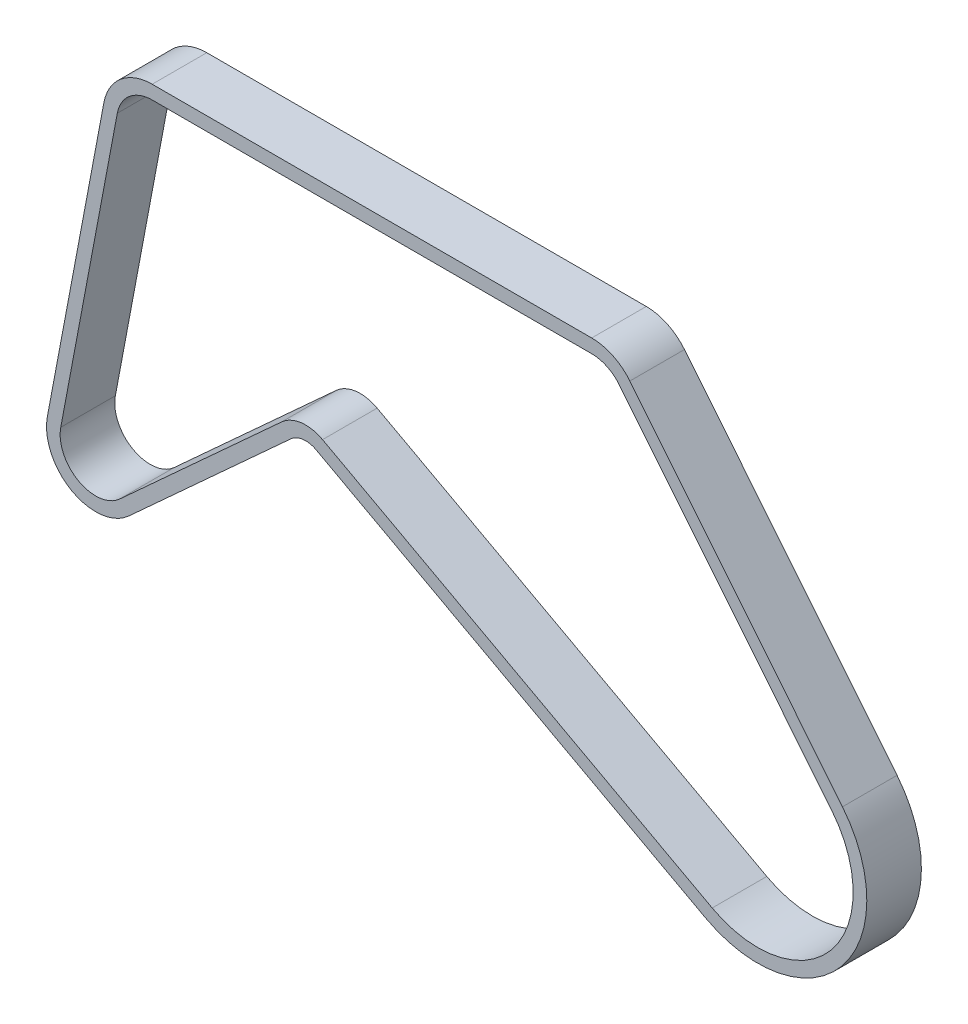
ISO-10303-21;
HEADER;
FILE_DESCRIPTION(('STEP AP214'),'2;1');
FILE_NAME('part.step','',(''),(''),'','','');
FILE_SCHEMA(('AUTOMOTIVE_DESIGN { 1 0 10303 214 1 1 1 1 }'));
ENDSEC;
DATA;
#1=APPLICATION_CONTEXT('core data for automotive mechanical design processes');
#2=APPLICATION_PROTOCOL_DEFINITION('international standard','automotive_design',2000,#1);
#3=PRODUCT_CONTEXT('',#1,'mechanical');
#4=PRODUCT('Part','Part','',(#3));
#5=PRODUCT_RELATED_PRODUCT_CATEGORY('part','',(#4));
#6=PRODUCT_DEFINITION_FORMATION('','',#4);
#7=PRODUCT_DEFINITION_CONTEXT('part definition',#1,'design');
#8=PRODUCT_DEFINITION('design','',#6,#7);
#9=PRODUCT_DEFINITION_SHAPE('','',#8);
#10=(LENGTH_UNIT() NAMED_UNIT(*) SI_UNIT(.MILLI.,.METRE.));
#11=(NAMED_UNIT(*) PLANE_ANGLE_UNIT() SI_UNIT($,.RADIAN.));
#12=(NAMED_UNIT(*) SI_UNIT($,.STERADIAN.) SOLID_ANGLE_UNIT());
#13=UNCERTAINTY_MEASURE_WITH_UNIT(LENGTH_MEASURE(1.E-05),#10,'distance_accuracy_value','');
#14=(GEOMETRIC_REPRESENTATION_CONTEXT(3) GLOBAL_UNCERTAINTY_ASSIGNED_CONTEXT((#13)) GLOBAL_UNIT_ASSIGNED_CONTEXT((#10,
#11,#12)) REPRESENTATION_CONTEXT('',''));
#15=CARTESIAN_POINT('',(0.,0.,0.));
#16=DIRECTION('',(0.,0.,1.));
#17=DIRECTION('',(1.,0.,0.));
#18=AXIS2_PLACEMENT_3D('',#15,#16,#17);
#19=CARTESIAN_POINT('',(-165.587686167173,35.,10.));
#20=DIRECTION('',(0.,0.,-1.));
#21=DIRECTION('',(-1.,0.,0.));
#22=AXIS2_PLACEMENT_3D('',#19,#20,#21);
#23=PLANE('',#22);
#24=CARTESIAN_POINT('',(-165.587686167173,35.,10.));
#25=DIRECTION('',(0.,0.,-1.));
#26=DIRECTION('',(-1.,0.,0.));
#27=AXIS2_PLACEMENT_3D('',#24,#25,#26);
#28=CIRCLE('',#27,8.);
#29=CARTESIAN_POINT('',(-170.979219547743,40.9102764576799,10.));
#30=VERTEX_POINT('',#29);
#31=CARTESIAN_POINT('',(-161.781383654942,42.0364807386491,10.));
#32=VERTEX_POINT('',#31);
#33=EDGE_CURVE('E311',#30,#32,#28,.T.);
#34=ORIENTED_EDGE('',*,*,#33,.T.);
#35=DIRECTION('',(0.879560092331139,-0.475787814028941,0.));
#36=VECTOR('',#35,1.);
#37=CARTESIAN_POINT('',(-161.781383654942,42.0364807386491,10.));
#38=LINE('',#37,#36);
#39=CARTESIAN_POINT('',(-19.0315125611577,-35.1824036932456,10.));
#40=VERTEX_POINT('',#39);
#41=EDGE_CURVE('E314',#32,#40,#38,.T.);
#42=ORIENTED_EDGE('',*,*,#41,.T.);
#43=CARTESIAN_POINT('',(0.,0.,10.));
#44=DIRECTION('',(0.,0.,-1.));
#45=DIRECTION('',(-1.,0.,0.));
#46=AXIS2_PLACEMENT_3D('',#43,#44,#45);
#47=CIRCLE('',#46,40.);
#48=CARTESIAN_POINT('',(31.0817006326549,25.1779245725699,10.));
#49=VERTEX_POINT('',#48);
#50=EDGE_CURVE('E317',#40,#49,#47,.F.);
#51=ORIENTED_EDGE('',*,*,#50,.T.);
#52=DIRECTION('',(-0.629448114314247,0.777042515816373,0.));
#53=VECTOR('',#52,1.);
#54=CARTESIAN_POINT('',(-51.6437348658195,127.301005188628,10.));
#55=LINE('',#54,#53);
#56=CARTESIAN_POINT('',(-46.8069385513648,121.330066057656,10.));
#57=VERTEX_POINT('',#56);
#58=EDGE_CURVE('E319',#49,#57,#55,.T.);
#59=ORIENTED_EDGE('',*,*,#58,.T.);
#60=CARTESIAN_POINT('',(-60.7937038360595,110.,10.));
#61=DIRECTION('',(0.,0.,-1.));
#62=DIRECTION('',(-1.,0.,0.));
#63=AXIS2_PLACEMENT_3D('',#60,#61,#62);
#64=CIRCLE('',#63,18.);
#65=CARTESIAN_POINT('',(-60.7937038360595,128.,10.));
#66=VERTEX_POINT('',#65);
#67=EDGE_CURVE('E321',#57,#66,#64,.F.);
#68=ORIENTED_EDGE('',*,*,#67,.T.);
#69=DIRECTION('',(-1.,0.,0.));
#70=VECTOR('',#69,1.);
#71=CARTESIAN_POINT('',(-165.587686167173,128.,10.));
#72=LINE('',#71,#70);
#73=CARTESIAN_POINT('',(-221.819075448222,128.,10.));
#74=VERTEX_POINT('',#73);
#75=EDGE_CURVE('E323',#66,#74,#72,.T.);
#76=ORIENTED_EDGE('',*,*,#75,.T.);
#77=CARTESIAN_POINT('',(-221.819075448222,110.,10.));
#78=DIRECTION('',(0.,0.,-1.));
#79=DIRECTION('',(-1.,0.,0.));
#80=AXIS2_PLACEMENT_3D('',#77,#78,#79);
#81=CIRCLE('',#80,18.);
#82=CARTESIAN_POINT('',(-239.508144261889,113.331192655093,10.));
#83=VERTEX_POINT('',#82);
#84=EDGE_CURVE('E325',#74,#83,#81,.F.);
#85=ORIENTED_EDGE('',*,*,#84,.T.);
#86=DIRECTION('',(-0.185066258616305,-0.98272604520373,0.));
#87=VECTOR('',#86,1.);
#88=CARTESIAN_POINT('',(-251.22245359798,51.1266775142926,10.));
#89=LINE('',#88,#87);
#90=CARTESIAN_POINT('',(-260.22326476485,3.33119265509345,10.));
#91=VERTEX_POINT('',#90);
#92=EDGE_CURVE('E327',#83,#91,#89,.T.);
#93=ORIENTED_EDGE('',*,*,#92,.T.);
#94=CARTESIAN_POINT('',(-242.534195951183,0.,10.));
#95=DIRECTION('',(0.,0.,-1.));
#96=DIRECTION('',(-1.,0.,0.));
#97=AXIS2_PLACEMENT_3D('',#94,#95,#96);
#98=CIRCLE('',#97,18.);
#99=CARTESIAN_POINT('',(-230.403245844902,-13.2981220297799,10.));
#100=VERTEX_POINT('',#99);
#101=EDGE_CURVE('E329',#91,#100,#98,.F.);
#102=ORIENTED_EDGE('',*,*,#101,.T.);
#103=DIRECTION('',(0.738784557209993,0.673941672571177,0.));
#104=VECTOR('',#103,1.);
#105=CARTESIAN_POINT('',(-170.979219547743,40.9102764576799,10.));
#106=LINE('',#105,#104);
#107=EDGE_CURVE('E331',#100,#30,#106,.T.);
#108=ORIENTED_EDGE('',*,*,#107,.T.);
#109=EDGE_LOOP('',(#34,#42,#51,#59,#68,#76,#85,#93,#102,#108));
#110=FACE_BOUND('',#109,.T.);
#111=CARTESIAN_POINT('',(-165.587686167173,35.,10.));
#112=DIRECTION('',(0.,0.,-1.));
#113=DIRECTION('',(-1.,0.,0.));
#114=AXIS2_PLACEMENT_3D('',#111,#112,#113);
#115=CIRCLE('',#114,13.);
#116=CARTESIAN_POINT('',(-174.348927910599,44.6041992437299,10.));
#117=VERTEX_POINT('',#116);
#118=CARTESIAN_POINT('',(-159.402444584797,46.4342812003048,10.));
#119=VERTEX_POINT('',#118);
#120=EDGE_CURVE('E232',#117,#119,#115,.T.);
#121=ORIENTED_EDGE('',*,*,#120,.F.);
#122=DIRECTION('',(0.738784557209993,0.673941672571177,0.));
#123=VECTOR('',#122,1.);
#124=CARTESIAN_POINT('',(-233.772954207758,-9.60419924372994,10.));
#125=LINE('',#124,#123);
#126=CARTESIAN_POINT('',(-233.772954207758,-9.60419924372993,10.));
#127=VERTEX_POINT('',#126);
#128=EDGE_CURVE('E269',#127,#117,#125,.T.);
#129=ORIENTED_EDGE('',*,*,#128,.F.);
#130=CARTESIAN_POINT('',(-242.534195951183,0.,10.));
#131=DIRECTION('',(0.,0.,1.));
#132=DIRECTION('',(1.,0.,0.));
#133=AXIS2_PLACEMENT_3D('',#130,#131,#132);
#134=CIRCLE('',#133,13.);
#135=CARTESIAN_POINT('',(-255.309634538831,2.40586136201193,10.));
#136=VERTEX_POINT('',#135);
#137=EDGE_CURVE('E267',#136,#127,#134,.T.);
#138=ORIENTED_EDGE('',*,*,#137,.F.);
#139=DIRECTION('',(-0.185066258616305,-0.98272604520373,0.));
#140=VECTOR('',#139,1.);
#141=CARTESIAN_POINT('',(-234.59451403587,112.405861362012,10.));
#142=LINE('',#141,#140);
#143=CARTESIAN_POINT('',(-234.59451403587,112.405861362012,10.));
#144=VERTEX_POINT('',#143);
#145=EDGE_CURVE('E265',#144,#136,#142,.T.);
#146=ORIENTED_EDGE('',*,*,#145,.F.);
#147=CARTESIAN_POINT('',(-221.819075448222,110.,10.));
#148=DIRECTION('',(0.,0.,1.));
#149=DIRECTION('',(1.,0.,0.));
#150=AXIS2_PLACEMENT_3D('',#147,#148,#149);
#151=CIRCLE('',#150,13.);
#152=CARTESIAN_POINT('',(-221.819075448222,123.,10.));
#153=VERTEX_POINT('',#152);
#154=EDGE_CURVE('E263',#153,#144,#151,.T.);
#155=ORIENTED_EDGE('',*,*,#154,.F.);
#156=DIRECTION('',(-1.,0.,0.));
#157=VECTOR('',#156,1.);
#158=CARTESIAN_POINT('',(-60.7937038360595,123.,10.));
#159=LINE('',#158,#157);
#160=CARTESIAN_POINT('',(-60.7937038360595,123.,10.));
#161=VERTEX_POINT('',#160);
#162=EDGE_CURVE('E261',#161,#153,#159,.T.);
#163=ORIENTED_EDGE('',*,*,#162,.F.);
#164=CARTESIAN_POINT('',(-60.7937038360595,110.,10.));
#165=DIRECTION('',(0.,0.,1.));
#166=DIRECTION('',(1.,0.,0.));
#167=AXIS2_PLACEMENT_3D('',#164,#165,#166);
#168=CIRCLE('',#167,13.);
#169=CARTESIAN_POINT('',(-50.6921511304467,118.182825486085,10.));
#170=VERTEX_POINT('',#169);
#171=EDGE_CURVE('E259',#170,#161,#168,.T.);
#172=ORIENTED_EDGE('',*,*,#171,.F.);
#173=DIRECTION('',(-0.629448114314247,0.777042515816373,0.));
#174=VECTOR('',#173,1.);
#175=CARTESIAN_POINT('',(27.1964880535731,22.0306840009987,10.));
#176=LINE('',#175,#174);
#177=CARTESIAN_POINT('',(27.1964880535731,22.0306840009986,10.));
#178=VERTEX_POINT('',#177);
#179=EDGE_CURVE('E255',#178,#170,#176,.T.);
#180=ORIENTED_EDGE('',*,*,#179,.F.);
#181=CARTESIAN_POINT('',(0.,0.,10.));
#182=DIRECTION('',(0.,0.,1.));
#183=DIRECTION('',(1.,0.,0.));
#184=AXIS2_PLACEMENT_3D('',#181,#182,#183);
#185=CIRCLE('',#184,35.);
#186=CARTESIAN_POINT('',(-16.652573491013,-30.7846032315899,10.));
#187=VERTEX_POINT('',#186);
#188=EDGE_CURVE('E253',#187,#178,#185,.T.);
#189=ORIENTED_EDGE('',*,*,#188,.F.);
#190=DIRECTION('',(0.879560092331139,-0.475787814028941,0.));
#191=VECTOR('',#190,1.);
#192=CARTESIAN_POINT('',(-159.402444584797,46.4342812003048,10.));
#193=LINE('',#192,#191);
#194=EDGE_CURVE('E240',#119,#187,#193,.T.);
#195=ORIENTED_EDGE('',*,*,#194,.F.);
#196=EDGE_LOOP('',(#121,#129,#138,#146,#155,#163,#172,#180,#189,#195));
#197=FACE_BOUND('',#196,.T.);
#198=ADVANCED_FACE('F95',(#110,#197),#23,.F.);
#199=CARTESIAN_POINT('',(-165.587686167173,35.,-10.));
#200=DIRECTION('',(0.,0.,-1.));
#201=DIRECTION('',(-1.,0.,0.));
#202=AXIS2_PLACEMENT_3D('',#199,#200,#201);
#203=PLANE('',#202);
#204=CARTESIAN_POINT('',(-165.587686167173,35.,-10.));
#205=DIRECTION('',(0.,0.,-1.));
#206=DIRECTION('',(-1.,0.,0.));
#207=AXIS2_PLACEMENT_3D('',#204,#205,#206);
#208=CIRCLE('',#207,8.);
#209=CARTESIAN_POINT('',(-170.979219547743,40.9102764576799,-10.));
#210=VERTEX_POINT('',#209);
#211=CARTESIAN_POINT('',(-161.781383654942,42.0364807386491,-10.));
#212=VERTEX_POINT('',#211);
#213=EDGE_CURVE('E248',#210,#212,#208,.T.);
#214=ORIENTED_EDGE('',*,*,#213,.F.);
#215=DIRECTION('',(0.738784557209993,0.673941672571177,0.));
#216=VECTOR('',#215,1.);
#217=CARTESIAN_POINT('',(-170.979219547743,40.9102764576799,-10.));
#218=LINE('',#217,#216);
#219=CARTESIAN_POINT('',(-230.403245844902,-13.2981220297799,-10.));
#220=VERTEX_POINT('',#219);
#221=EDGE_CURVE('E315',#220,#210,#218,.T.);
#222=ORIENTED_EDGE('',*,*,#221,.F.);
#223=CARTESIAN_POINT('',(-242.534195951183,0.,-10.));
#224=DIRECTION('',(0.,0.,-1.));
#225=DIRECTION('',(-1.,0.,0.));
#226=AXIS2_PLACEMENT_3D('',#223,#224,#225);
#227=CIRCLE('',#226,18.);
#228=CARTESIAN_POINT('',(-260.22326476485,3.33119265509345,-10.));
#229=VERTEX_POINT('',#228);
#230=EDGE_CURVE('E350',#229,#220,#227,.F.);
#231=ORIENTED_EDGE('',*,*,#230,.F.);
#232=DIRECTION('',(-0.185066258616305,-0.98272604520373,0.));
#233=VECTOR('',#232,1.);
#234=CARTESIAN_POINT('',(-251.22245359798,51.1266775142926,-10.));
#235=LINE('',#234,#233);
#236=CARTESIAN_POINT('',(-239.508144261889,113.331192655093,-10.));
#237=VERTEX_POINT('',#236);
#238=EDGE_CURVE('E348',#237,#229,#235,.T.);
#239=ORIENTED_EDGE('',*,*,#238,.F.);
#240=CARTESIAN_POINT('',(-221.819075448222,110.,-10.));
#241=DIRECTION('',(0.,0.,-1.));
#242=DIRECTION('',(-1.,0.,0.));
#243=AXIS2_PLACEMENT_3D('',#240,#241,#242);
#244=CIRCLE('',#243,18.);
#245=CARTESIAN_POINT('',(-221.819075448222,128.,-10.));
#246=VERTEX_POINT('',#245);
#247=EDGE_CURVE('E346',#246,#237,#244,.F.);
#248=ORIENTED_EDGE('',*,*,#247,.F.);
#249=DIRECTION('',(-1.,0.,0.));
#250=VECTOR('',#249,1.);
#251=CARTESIAN_POINT('',(-165.587686167173,128.,-10.));
#252=LINE('',#251,#250);
#253=CARTESIAN_POINT('',(-60.7937038360595,128.,-10.));
#254=VERTEX_POINT('',#253);
#255=EDGE_CURVE('E344',#254,#246,#252,.T.);
#256=ORIENTED_EDGE('',*,*,#255,.F.);
#257=CARTESIAN_POINT('',(-60.7937038360595,110.,-10.));
#258=DIRECTION('',(0.,0.,-1.));
#259=DIRECTION('',(-1.,0.,0.));
#260=AXIS2_PLACEMENT_3D('',#257,#258,#259);
#261=CIRCLE('',#260,18.);
#262=CARTESIAN_POINT('',(-46.8069385513648,121.330066057656,-10.));
#263=VERTEX_POINT('',#262);
#264=EDGE_CURVE('E342',#263,#254,#261,.F.);
#265=ORIENTED_EDGE('',*,*,#264,.F.);
#266=DIRECTION('',(-0.629448114314247,0.777042515816373,0.));
#267=VECTOR('',#266,1.);
#268=CARTESIAN_POINT('',(-51.6437348658195,127.301005188628,-10.));
#269=LINE('',#268,#267);
#270=CARTESIAN_POINT('',(31.0817006326549,25.1779245725699,-10.));
#271=VERTEX_POINT('',#270);
#272=EDGE_CURVE('E340',#271,#263,#269,.T.);
#273=ORIENTED_EDGE('',*,*,#272,.F.);
#274=CARTESIAN_POINT('',(0.,0.,-10.));
#275=DIRECTION('',(0.,0.,-1.));
#276=DIRECTION('',(-1.,0.,0.));
#277=AXIS2_PLACEMENT_3D('',#274,#275,#276);
#278=CIRCLE('',#277,40.);
#279=CARTESIAN_POINT('',(-19.0315125611577,-35.1824036932456,-10.));
#280=VERTEX_POINT('',#279);
#281=EDGE_CURVE('E338',#280,#271,#278,.F.);
#282=ORIENTED_EDGE('',*,*,#281,.F.);
#283=DIRECTION('',(0.879560092331139,-0.475787814028941,0.));
#284=VECTOR('',#283,1.);
#285=CARTESIAN_POINT('',(-161.781383654942,42.0364807386491,-10.));
#286=LINE('',#285,#284);
#287=EDGE_CURVE('E336',#212,#280,#286,.T.);
#288=ORIENTED_EDGE('',*,*,#287,.F.);
#289=EDGE_LOOP('',(#214,#222,#231,#239,#248,#256,#265,#273,#282,#288));
#290=FACE_BOUND('',#289,.T.);
#291=DIRECTION('',(0.738784557209993,0.673941672571177,0.));
#292=VECTOR('',#291,1.);
#293=CARTESIAN_POINT('',(-233.772954207758,-9.60419924372994,-10.));
#294=LINE('',#293,#292);
#295=CARTESIAN_POINT('',(-233.772954207758,-9.60419924372994,-10.));
#296=VERTEX_POINT('',#295);
#297=CARTESIAN_POINT('',(-174.348927910599,44.6041992437299,-10.));
#298=VERTEX_POINT('',#297);
#299=EDGE_CURVE('E241',#296,#298,#294,.T.);
#300=ORIENTED_EDGE('',*,*,#299,.T.);
#301=CARTESIAN_POINT('',(-165.587686167173,35.,-10.));
#302=DIRECTION('',(0.,0.,-1.));
#303=DIRECTION('',(-1.,0.,0.));
#304=AXIS2_PLACEMENT_3D('',#301,#302,#303);
#305=CIRCLE('',#304,13.);
#306=CARTESIAN_POINT('',(-159.402444584797,46.4342812003048,-10.));
#307=VERTEX_POINT('',#306);
#308=EDGE_CURVE('E118',#298,#307,#305,.T.);
#309=ORIENTED_EDGE('',*,*,#308,.T.);
#310=DIRECTION('',(0.879560092331139,-0.475787814028941,0.));
#311=VECTOR('',#310,1.);
#312=CARTESIAN_POINT('',(-159.402444584797,46.4342812003048,-10.));
#313=LINE('',#312,#311);
#314=CARTESIAN_POINT('',(-16.652573491013,-30.7846032315899,-10.));
#315=VERTEX_POINT('',#314);
#316=EDGE_CURVE('E247',#307,#315,#313,.T.);
#317=ORIENTED_EDGE('',*,*,#316,.T.);
#318=CARTESIAN_POINT('',(0.,0.,-10.));
#319=DIRECTION('',(0.,0.,1.));
#320=DIRECTION('',(1.,0.,0.));
#321=AXIS2_PLACEMENT_3D('',#318,#319,#320);
#322=CIRCLE('',#321,35.);
#323=CARTESIAN_POINT('',(27.1964880535731,22.0306840009986,-10.));
#324=VERTEX_POINT('',#323);
#325=EDGE_CURVE('E273',#315,#324,#322,.T.);
#326=ORIENTED_EDGE('',*,*,#325,.T.);
#327=DIRECTION('',(-0.629448114314247,0.777042515816373,0.));
#328=VECTOR('',#327,1.);
#329=CARTESIAN_POINT('',(27.1964880535731,22.0306840009987,-10.));
#330=LINE('',#329,#328);
#331=CARTESIAN_POINT('',(-50.6921511304467,118.182825486085,-10.));
#332=VERTEX_POINT('',#331);
#333=EDGE_CURVE('E276',#324,#332,#330,.T.);
#334=ORIENTED_EDGE('',*,*,#333,.T.);
#335=CARTESIAN_POINT('',(-60.7937038360595,110.,-10.));
#336=DIRECTION('',(0.,0.,1.));
#337=DIRECTION('',(1.,0.,0.));
#338=AXIS2_PLACEMENT_3D('',#335,#336,#337);
#339=CIRCLE('',#338,13.);
#340=CARTESIAN_POINT('',(-60.7937038360595,123.,-10.));
#341=VERTEX_POINT('',#340);
#342=EDGE_CURVE('E279',#332,#341,#339,.T.);
#343=ORIENTED_EDGE('',*,*,#342,.T.);
#344=DIRECTION('',(-1.,0.,0.));
#345=VECTOR('',#344,1.);
#346=CARTESIAN_POINT('',(-60.7937038360595,123.,-10.));
#347=LINE('',#346,#345);
#348=CARTESIAN_POINT('',(-221.819075448222,123.,-10.));
#349=VERTEX_POINT('',#348);
#350=EDGE_CURVE('E282',#341,#349,#347,.T.);
#351=ORIENTED_EDGE('',*,*,#350,.T.);
#352=CARTESIAN_POINT('',(-221.819075448222,110.,-10.));
#353=DIRECTION('',(0.,0.,1.));
#354=DIRECTION('',(1.,0.,0.));
#355=AXIS2_PLACEMENT_3D('',#352,#353,#354);
#356=CIRCLE('',#355,13.);
#357=CARTESIAN_POINT('',(-234.59451403587,112.405861362012,-10.));
#358=VERTEX_POINT('',#357);
#359=EDGE_CURVE('E285',#349,#358,#356,.T.);
#360=ORIENTED_EDGE('',*,*,#359,.T.);
#361=DIRECTION('',(-0.185066258616305,-0.98272604520373,0.));
#362=VECTOR('',#361,1.);
#363=CARTESIAN_POINT('',(-234.59451403587,112.405861362012,-10.));
#364=LINE('',#363,#362);
#365=CARTESIAN_POINT('',(-255.309634538831,2.40586136201193,-10.));
#366=VERTEX_POINT('',#365);
#367=EDGE_CURVE('E288',#358,#366,#364,.T.);
#368=ORIENTED_EDGE('',*,*,#367,.T.);
#369=CARTESIAN_POINT('',(-242.534195951183,0.,-10.));
#370=DIRECTION('',(0.,0.,1.));
#371=DIRECTION('',(1.,0.,0.));
#372=AXIS2_PLACEMENT_3D('',#369,#370,#371);
#373=CIRCLE('',#372,13.);
#374=EDGE_CURVE('E291',#366,#296,#373,.T.);
#375=ORIENTED_EDGE('',*,*,#374,.T.);
#376=EDGE_LOOP('',(#300,#309,#317,#326,#334,#343,#351,#360,#368,#375));
#377=FACE_BOUND('',#376,.T.);
#378=ADVANCED_FACE('F386',(#290,#377),#203,.T.);
#379=CARTESIAN_POINT('',(-165.587686167173,35.,10.));
#380=DIRECTION('',(0.,0.,-1.));
#381=DIRECTION('',(-1.,0.,0.));
#382=AXIS2_PLACEMENT_3D('',#379,#380,#381);
#383=CYLINDRICAL_SURFACE('',#382,8.);
#384=ORIENTED_EDGE('',*,*,#213,.T.);
#385=DIRECTION('',(0.,0.,-1.));
#386=VECTOR('',#385,1.);
#387=CARTESIAN_POINT('',(-161.781383654942,42.0364807386491,10.));
#388=LINE('',#387,#386);
#389=EDGE_CURVE('E12',#32,#212,#388,.T.);
#390=ORIENTED_EDGE('',*,*,#389,.F.);
#391=ORIENTED_EDGE('',*,*,#33,.F.);
#392=DIRECTION('',(0.,0.,-1.));
#393=VECTOR('',#392,1.);
#394=CARTESIAN_POINT('',(-170.979219547743,40.9102764576799,10.));
#395=LINE('',#394,#393);
#396=EDGE_CURVE('E333',#30,#210,#395,.T.);
#397=ORIENTED_EDGE('',*,*,#396,.T.);
#398=EDGE_LOOP('',(#384,#390,#391,#397));
#399=FACE_BOUND('',#398,.T.);
#400=ADVANCED_FACE('F97',(#399),#383,.F.);
#401=CARTESIAN_POINT('',(-161.781383654942,42.0364807386491,10.));
#402=DIRECTION('',(0.475787814028941,0.879560092331139,0.));
#403=DIRECTION('',(-0.879560092331139,0.475787814028941,0.));
#404=AXIS2_PLACEMENT_3D('',#401,#402,#403);
#405=PLANE('',#404);
#406=ORIENTED_EDGE('',*,*,#287,.T.);
#407=DIRECTION('',(0.,0.,-1.));
#408=VECTOR('',#407,1.);
#409=CARTESIAN_POINT('',(-19.0315125611577,-35.1824036932456,10.));
#410=LINE('',#409,#408);
#411=EDGE_CURVE('E103',#40,#280,#410,.T.);
#412=ORIENTED_EDGE('',*,*,#411,.F.);
#413=ORIENTED_EDGE('',*,*,#41,.F.);
#414=ORIENTED_EDGE('',*,*,#389,.T.);
#415=EDGE_LOOP('',(#406,#412,#413,#414));
#416=FACE_BOUND('',#415,.T.);
#417=ADVANCED_FACE('F403',(#416),#405,.F.);
#418=CARTESIAN_POINT('',(0.,0.,10.));
#419=DIRECTION('',(0.,0.,-1.));
#420=DIRECTION('',(-1.,0.,0.));
#421=AXIS2_PLACEMENT_3D('',#418,#419,#420);
#422=CYLINDRICAL_SURFACE('',#421,40.);
#423=ORIENTED_EDGE('',*,*,#281,.T.);
#424=DIRECTION('',(0.,0.,-1.));
#425=VECTOR('',#424,1.);
#426=CARTESIAN_POINT('',(31.0817006326549,25.1779245725699,10.));
#427=LINE('',#426,#425);
#428=EDGE_CURVE('E373',#49,#271,#427,.T.);
#429=ORIENTED_EDGE('',*,*,#428,.F.);
#430=ORIENTED_EDGE('',*,*,#50,.F.);
#431=ORIENTED_EDGE('',*,*,#411,.T.);
#432=EDGE_LOOP('',(#423,#429,#430,#431));
#433=FACE_BOUND('',#432,.T.);
#434=ADVANCED_FACE('F380',(#433),#422,.T.);
#435=CARTESIAN_POINT('',(-51.6437348658195,127.301005188628,10.));
#436=DIRECTION('',(-0.777042515816373,-0.629448114314247,0.));
#437=DIRECTION('',(0.629448114314247,-0.777042515816373,0.));
#438=AXIS2_PLACEMENT_3D('',#435,#436,#437);
#439=PLANE('',#438);
#440=ORIENTED_EDGE('',*,*,#272,.T.);
#441=DIRECTION('',(0.,0.,-1.));
#442=VECTOR('',#441,1.);
#443=CARTESIAN_POINT('',(-46.8069385513648,121.330066057656,10.));
#444=LINE('',#443,#442);
#445=EDGE_CURVE('E370',#57,#263,#444,.T.);
#446=ORIENTED_EDGE('',*,*,#445,.F.);
#447=ORIENTED_EDGE('',*,*,#58,.F.);
#448=ORIENTED_EDGE('',*,*,#428,.T.);
#449=EDGE_LOOP('',(#440,#446,#447,#448));
#450=FACE_BOUND('',#449,.T.);
#451=ADVANCED_FACE('F392',(#450),#439,.F.);
#452=CARTESIAN_POINT('',(-60.7937038360595,110.,10.));
#453=DIRECTION('',(0.,0.,-1.));
#454=DIRECTION('',(-1.,0.,0.));
#455=AXIS2_PLACEMENT_3D('',#452,#453,#454);
#456=CYLINDRICAL_SURFACE('',#455,18.);
#457=ORIENTED_EDGE('',*,*,#264,.T.);
#458=DIRECTION('',(0.,0.,-1.));
#459=VECTOR('',#458,1.);
#460=CARTESIAN_POINT('',(-60.7937038360595,128.,10.));
#461=LINE('',#460,#459);
#462=EDGE_CURVE('E367',#66,#254,#461,.T.);
#463=ORIENTED_EDGE('',*,*,#462,.F.);
#464=ORIENTED_EDGE('',*,*,#67,.F.);
#465=ORIENTED_EDGE('',*,*,#445,.T.);
#466=EDGE_LOOP('',(#457,#463,#464,#465));
#467=FACE_BOUND('',#466,.T.);
#468=ADVANCED_FACE('F396',(#467),#456,.T.);
#469=CARTESIAN_POINT('',(-165.587686167173,128.,10.));
#470=DIRECTION('',(0.,-1.,0.));
#471=DIRECTION('',(0.,0.,-1.));
#472=AXIS2_PLACEMENT_3D('',#469,#470,#471);
#473=PLANE('',#472);
#474=ORIENTED_EDGE('',*,*,#255,.T.);
#475=DIRECTION('',(0.,0.,-1.));
#476=VECTOR('',#475,1.);
#477=CARTESIAN_POINT('',(-221.819075448222,128.,10.));
#478=LINE('',#477,#476);
#479=EDGE_CURVE('E364',#74,#246,#478,.T.);
#480=ORIENTED_EDGE('',*,*,#479,.F.);
#481=ORIENTED_EDGE('',*,*,#75,.F.);
#482=ORIENTED_EDGE('',*,*,#462,.T.);
#483=EDGE_LOOP('',(#474,#480,#481,#482));
#484=FACE_BOUND('',#483,.T.);
#485=ADVANCED_FACE('F426',(#484),#473,.F.);
#486=CARTESIAN_POINT('',(-221.819075448222,110.,10.));
#487=DIRECTION('',(0.,0.,-1.));
#488=DIRECTION('',(-1.,0.,0.));
#489=AXIS2_PLACEMENT_3D('',#486,#487,#488);
#490=CYLINDRICAL_SURFACE('',#489,18.);
#491=ORIENTED_EDGE('',*,*,#247,.T.);
#492=DIRECTION('',(0.,0.,-1.));
#493=VECTOR('',#492,1.);
#494=CARTESIAN_POINT('',(-239.508144261889,113.331192655093,10.));
#495=LINE('',#494,#493);
#496=EDGE_CURVE('E361',#83,#237,#495,.T.);
#497=ORIENTED_EDGE('',*,*,#496,.F.);
#498=ORIENTED_EDGE('',*,*,#84,.F.);
#499=ORIENTED_EDGE('',*,*,#479,.T.);
#500=EDGE_LOOP('',(#491,#497,#498,#499));
#501=FACE_BOUND('',#500,.T.);
#502=ADVANCED_FACE('F423',(#501),#490,.T.);
#503=CARTESIAN_POINT('',(-251.22245359798,51.1266775142926,10.));
#504=DIRECTION('',(0.98272604520373,-0.185066258616305,0.));
#505=DIRECTION('',(0.185066258616305,0.98272604520373,0.));
#506=AXIS2_PLACEMENT_3D('',#503,#504,#505);
#507=PLANE('',#506);
#508=ORIENTED_EDGE('',*,*,#238,.T.);
#509=DIRECTION('',(0.,0.,-1.));
#510=VECTOR('',#509,1.);
#511=CARTESIAN_POINT('',(-260.22326476485,3.33119265509345,10.));
#512=LINE('',#511,#510);
#513=EDGE_CURVE('E358',#91,#229,#512,.T.);
#514=ORIENTED_EDGE('',*,*,#513,.F.);
#515=ORIENTED_EDGE('',*,*,#92,.F.);
#516=ORIENTED_EDGE('',*,*,#496,.T.);
#517=EDGE_LOOP('',(#508,#514,#515,#516));
#518=FACE_BOUND('',#517,.T.);
#519=ADVANCED_FACE('F419',(#518),#507,.F.);
#520=CARTESIAN_POINT('',(-242.534195951183,0.,10.));
#521=DIRECTION('',(0.,0.,-1.));
#522=DIRECTION('',(-1.,0.,0.));
#523=AXIS2_PLACEMENT_3D('',#520,#521,#522);
#524=CYLINDRICAL_SURFACE('',#523,18.);
#525=ORIENTED_EDGE('',*,*,#230,.T.);
#526=DIRECTION('',(0.,0.,-1.));
#527=VECTOR('',#526,1.);
#528=CARTESIAN_POINT('',(-230.403245844902,-13.2981220297799,10.));
#529=LINE('',#528,#527);
#530=EDGE_CURVE('E355',#100,#220,#529,.T.);
#531=ORIENTED_EDGE('',*,*,#530,.F.);
#532=ORIENTED_EDGE('',*,*,#101,.F.);
#533=ORIENTED_EDGE('',*,*,#513,.T.);
#534=EDGE_LOOP('',(#525,#531,#532,#533));
#535=FACE_BOUND('',#534,.T.);
#536=ADVANCED_FACE('F415',(#535),#524,.T.);
#537=CARTESIAN_POINT('',(-170.979219547743,40.9102764576799,10.));
#538=DIRECTION('',(-0.673941672571177,0.738784557209993,0.));
#539=DIRECTION('',(-0.738784557209993,-0.673941672571177,0.));
#540=AXIS2_PLACEMENT_3D('',#537,#538,#539);
#541=PLANE('',#540);
#542=ORIENTED_EDGE('',*,*,#221,.T.);
#543=ORIENTED_EDGE('',*,*,#396,.F.);
#544=ORIENTED_EDGE('',*,*,#107,.F.);
#545=ORIENTED_EDGE('',*,*,#530,.T.);
#546=EDGE_LOOP('',(#542,#543,#544,#545));
#547=FACE_BOUND('',#546,.T.);
#548=ADVANCED_FACE('F410',(#547),#541,.F.);
#549=CARTESIAN_POINT('',(-165.587686167173,35.,10.));
#550=DIRECTION('',(0.,0.,-1.));
#551=DIRECTION('',(-1.,0.,0.));
#552=AXIS2_PLACEMENT_3D('',#549,#550,#551);
#553=CYLINDRICAL_SURFACE('',#552,13.);
#554=ORIENTED_EDGE('',*,*,#308,.F.);
#555=DIRECTION('',(0.,0.,-1.));
#556=VECTOR('',#555,1.);
#557=CARTESIAN_POINT('',(-174.348927910599,44.6041992437299,10.));
#558=LINE('',#557,#556);
#559=EDGE_CURVE('E236',#117,#298,#558,.T.);
#560=ORIENTED_EDGE('',*,*,#559,.F.);
#561=ORIENTED_EDGE('',*,*,#120,.T.);
#562=DIRECTION('',(0.,0.,-1.));
#563=VECTOR('',#562,1.);
#564=CARTESIAN_POINT('',(-159.402444584797,46.4342812003048,10.));
#565=LINE('',#564,#563);
#566=EDGE_CURVE('E235',#119,#307,#565,.T.);
#567=ORIENTED_EDGE('',*,*,#566,.T.);
#568=EDGE_LOOP('',(#554,#560,#561,#567));
#569=FACE_BOUND('',#568,.T.);
#570=ADVANCED_FACE('F234',(#569),#553,.T.);
#571=CARTESIAN_POINT('',(-159.402444584797,46.4342812003048,10.));
#572=DIRECTION('',(0.475787814028941,0.879560092331139,0.));
#573=DIRECTION('',(-0.879560092331139,0.475787814028941,0.));
#574=AXIS2_PLACEMENT_3D('',#571,#572,#573);
#575=PLANE('',#574);
#576=ORIENTED_EDGE('',*,*,#316,.F.);
#577=ORIENTED_EDGE('',*,*,#566,.F.);
#578=ORIENTED_EDGE('',*,*,#194,.T.);
#579=DIRECTION('',(0.,0.,-1.));
#580=VECTOR('',#579,1.);
#581=CARTESIAN_POINT('',(-16.652573491013,-30.7846032315899,10.));
#582=LINE('',#581,#580);
#583=EDGE_CURVE('E249',#187,#315,#582,.T.);
#584=ORIENTED_EDGE('',*,*,#583,.T.);
#585=EDGE_LOOP('',(#576,#577,#578,#584));
#586=FACE_BOUND('',#585,.T.);
#587=ADVANCED_FACE('F244',(#586),#575,.T.);
#588=CARTESIAN_POINT('',(0.,0.,10.));
#589=DIRECTION('',(0.,0.,-1.));
#590=DIRECTION('',(-1.,0.,0.));
#591=AXIS2_PLACEMENT_3D('',#588,#589,#590);
#592=CYLINDRICAL_SURFACE('',#591,35.);
#593=ORIENTED_EDGE('',*,*,#325,.F.);
#594=ORIENTED_EDGE('',*,*,#583,.F.);
#595=ORIENTED_EDGE('',*,*,#188,.T.);
#596=DIRECTION('',(0.,0.,-1.));
#597=VECTOR('',#596,1.);
#598=CARTESIAN_POINT('',(27.1964880535731,22.0306840009986,10.));
#599=LINE('',#598,#597);
#600=EDGE_CURVE('E308',#178,#324,#599,.T.);
#601=ORIENTED_EDGE('',*,*,#600,.T.);
#602=EDGE_LOOP('',(#593,#594,#595,#601));
#603=FACE_BOUND('',#602,.T.);
#604=ADVANCED_FACE('F472',(#603),#592,.F.);
#605=CARTESIAN_POINT('',(27.1964880535731,22.0306840009987,10.));
#606=DIRECTION('',(-0.777042515816373,-0.629448114314247,0.));
#607=DIRECTION('',(0.629448114314247,-0.777042515816373,0.));
#608=AXIS2_PLACEMENT_3D('',#605,#606,#607);
#609=PLANE('',#608);
#610=ORIENTED_EDGE('',*,*,#333,.F.);
#611=ORIENTED_EDGE('',*,*,#600,.F.);
#612=ORIENTED_EDGE('',*,*,#179,.T.);
#613=DIRECTION('',(0.,0.,-1.));
#614=VECTOR('',#613,1.);
#615=CARTESIAN_POINT('',(-50.6921511304467,118.182825486085,10.));
#616=LINE('',#615,#614);
#617=EDGE_CURVE('E306',#170,#332,#616,.T.);
#618=ORIENTED_EDGE('',*,*,#617,.T.);
#619=EDGE_LOOP('',(#610,#611,#612,#618));
#620=FACE_BOUND('',#619,.T.);
#621=ADVANCED_FACE('F478',(#620),#609,.T.);
#622=CARTESIAN_POINT('',(-60.7937038360595,110.,10.));
#623=DIRECTION('',(0.,0.,-1.));
#624=DIRECTION('',(-1.,0.,0.));
#625=AXIS2_PLACEMENT_3D('',#622,#623,#624);
#626=CYLINDRICAL_SURFACE('',#625,13.);
#627=ORIENTED_EDGE('',*,*,#342,.F.);
#628=ORIENTED_EDGE('',*,*,#617,.F.);
#629=ORIENTED_EDGE('',*,*,#171,.T.);
#630=DIRECTION('',(0.,0.,-1.));
#631=VECTOR('',#630,1.);
#632=CARTESIAN_POINT('',(-60.7937038360595,123.,10.));
#633=LINE('',#632,#631);
#634=EDGE_CURVE('E304',#161,#341,#633,.T.);
#635=ORIENTED_EDGE('',*,*,#634,.T.);
#636=EDGE_LOOP('',(#627,#628,#629,#635));
#637=FACE_BOUND('',#636,.T.);
#638=ADVANCED_FACE('F486',(#637),#626,.F.);
#639=CARTESIAN_POINT('',(-60.7937038360595,123.,10.));
#640=DIRECTION('',(0.,-1.,0.));
#641=DIRECTION('',(0.,0.,-1.));
#642=AXIS2_PLACEMENT_3D('',#639,#640,#641);
#643=PLANE('',#642);
#644=ORIENTED_EDGE('',*,*,#350,.F.);
#645=ORIENTED_EDGE('',*,*,#634,.F.);
#646=ORIENTED_EDGE('',*,*,#162,.T.);
#647=DIRECTION('',(0.,0.,-1.));
#648=VECTOR('',#647,1.);
#649=CARTESIAN_POINT('',(-221.819075448222,123.,10.));
#650=LINE('',#649,#648);
#651=EDGE_CURVE('E302',#153,#349,#650,.T.);
#652=ORIENTED_EDGE('',*,*,#651,.T.);
#653=EDGE_LOOP('',(#644,#645,#646,#652));
#654=FACE_BOUND('',#653,.T.);
#655=ADVANCED_FACE('F494',(#654),#643,.T.);
#656=CARTESIAN_POINT('',(-221.819075448222,110.,10.));
#657=DIRECTION('',(0.,0.,-1.));
#658=DIRECTION('',(-1.,0.,0.));
#659=AXIS2_PLACEMENT_3D('',#656,#657,#658);
#660=CYLINDRICAL_SURFACE('',#659,13.);
#661=ORIENTED_EDGE('',*,*,#359,.F.);
#662=ORIENTED_EDGE('',*,*,#651,.F.);
#663=ORIENTED_EDGE('',*,*,#154,.T.);
#664=DIRECTION('',(0.,0.,-1.));
#665=VECTOR('',#664,1.);
#666=CARTESIAN_POINT('',(-234.59451403587,112.405861362012,10.));
#667=LINE('',#666,#665);
#668=EDGE_CURVE('E300',#144,#358,#667,.T.);
#669=ORIENTED_EDGE('',*,*,#668,.T.);
#670=EDGE_LOOP('',(#661,#662,#663,#669));
#671=FACE_BOUND('',#670,.T.);
#672=ADVANCED_FACE('F502',(#671),#660,.F.);
#673=CARTESIAN_POINT('',(-234.59451403587,112.405861362012,10.));
#674=DIRECTION('',(0.98272604520373,-0.185066258616305,0.));
#675=DIRECTION('',(0.185066258616305,0.98272604520373,0.));
#676=AXIS2_PLACEMENT_3D('',#673,#674,#675);
#677=PLANE('',#676);
#678=ORIENTED_EDGE('',*,*,#367,.F.);
#679=ORIENTED_EDGE('',*,*,#668,.F.);
#680=ORIENTED_EDGE('',*,*,#145,.T.);
#681=DIRECTION('',(0.,0.,-1.));
#682=VECTOR('',#681,1.);
#683=CARTESIAN_POINT('',(-255.309634538831,2.40586136201193,10.));
#684=LINE('',#683,#682);
#685=EDGE_CURVE('E298',#136,#366,#684,.T.);
#686=ORIENTED_EDGE('',*,*,#685,.T.);
#687=EDGE_LOOP('',(#678,#679,#680,#686));
#688=FACE_BOUND('',#687,.T.);
#689=ADVANCED_FACE('F510',(#688),#677,.T.);
#690=CARTESIAN_POINT('',(-242.534195951183,0.,10.));
#691=DIRECTION('',(0.,0.,-1.));
#692=DIRECTION('',(-1.,0.,0.));
#693=AXIS2_PLACEMENT_3D('',#690,#691,#692);
#694=CYLINDRICAL_SURFACE('',#693,13.);
#695=ORIENTED_EDGE('',*,*,#374,.F.);
#696=ORIENTED_EDGE('',*,*,#685,.F.);
#697=ORIENTED_EDGE('',*,*,#137,.T.);
#698=DIRECTION('',(0.,0.,-1.));
#699=VECTOR('',#698,1.);
#700=CARTESIAN_POINT('',(-233.772954207758,-9.60419924372994,10.));
#701=LINE('',#700,#699);
#702=EDGE_CURVE('E110',#127,#296,#701,.T.);
#703=ORIENTED_EDGE('',*,*,#702,.T.);
#704=EDGE_LOOP('',(#695,#696,#697,#703));
#705=FACE_BOUND('',#704,.T.);
#706=ADVANCED_FACE('F518',(#705),#694,.F.);
#707=CARTESIAN_POINT('',(-233.772954207758,-9.60419924372994,10.));
#708=DIRECTION('',(-0.673941672571177,0.738784557209993,0.));
#709=DIRECTION('',(-0.738784557209993,-0.673941672571177,0.));
#710=AXIS2_PLACEMENT_3D('',#707,#708,#709);
#711=PLANE('',#710);
#712=ORIENTED_EDGE('',*,*,#299,.F.);
#713=ORIENTED_EDGE('',*,*,#702,.F.);
#714=ORIENTED_EDGE('',*,*,#128,.T.);
#715=ORIENTED_EDGE('',*,*,#559,.T.);
#716=EDGE_LOOP('',(#712,#713,#714,#715));
#717=FACE_BOUND('',#716,.T.);
#718=ADVANCED_FACE('F526',(#717),#711,.T.);
#719=CLOSED_SHELL('',(#198,#378,#400,#417,#434,#451,#468,#485,#502,#519,#536,#548,#570,#587,
#604,#621,#638,#655,#672,#689,#706,#718));
#720=MANIFOLD_SOLID_BREP('B2',#719);
#721=ADVANCED_BREP_SHAPE_REPRESENTATION('',(#18,#720),#14);
#722=SHAPE_DEFINITION_REPRESENTATION(#9,#721);
ENDSEC;
END-ISO-10303-21;
